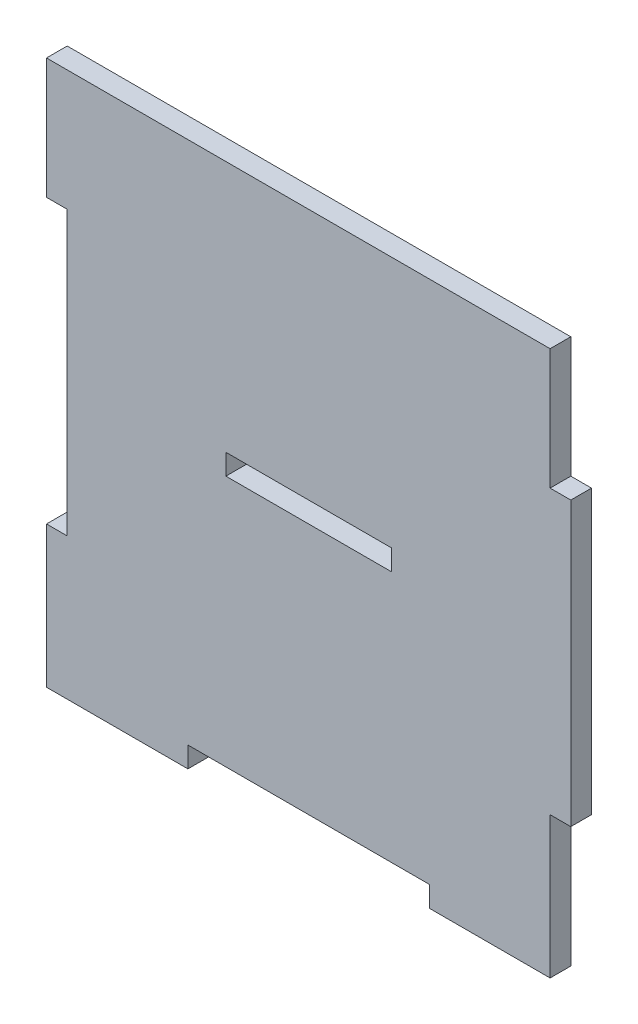
ISO-10303-21;
HEADER;
FILE_DESCRIPTION(('STEP AP214'),'2;1');
FILE_NAME('part.step','',(''),(''),'','','');
FILE_SCHEMA(('AUTOMOTIVE_DESIGN { 1 0 10303 214 1 1 1 1 }'));
ENDSEC;
DATA;
#1=APPLICATION_CONTEXT('core data for automotive mechanical design processes');
#2=APPLICATION_PROTOCOL_DEFINITION('international standard','automotive_design',2000,#1);
#3=PRODUCT_CONTEXT('',#1,'mechanical');
#4=PRODUCT('Part','Part','',(#3));
#5=PRODUCT_RELATED_PRODUCT_CATEGORY('part','',(#4));
#6=PRODUCT_DEFINITION_FORMATION('','',#4);
#7=PRODUCT_DEFINITION_CONTEXT('part definition',#1,'design');
#8=PRODUCT_DEFINITION('design','',#6,#7);
#9=PRODUCT_DEFINITION_SHAPE('','',#8);
#10=(LENGTH_UNIT() NAMED_UNIT(*) SI_UNIT(.MILLI.,.METRE.));
#11=(NAMED_UNIT(*) PLANE_ANGLE_UNIT() SI_UNIT($,.RADIAN.));
#12=(NAMED_UNIT(*) SI_UNIT($,.STERADIAN.) SOLID_ANGLE_UNIT());
#13=UNCERTAINTY_MEASURE_WITH_UNIT(LENGTH_MEASURE(1.E-05),#10,'distance_accuracy_value','');
#14=(GEOMETRIC_REPRESENTATION_CONTEXT(3) GLOBAL_UNCERTAINTY_ASSIGNED_CONTEXT((#13)) GLOBAL_UNIT_ASSIGNED_CONTEXT((#10,
#11,#12)) REPRESENTATION_CONTEXT('',''));
#15=CARTESIAN_POINT('',(0.,0.,0.));
#16=DIRECTION('',(0.,0.,1.));
#17=DIRECTION('',(1.,0.,0.));
#18=AXIS2_PLACEMENT_3D('',#15,#16,#17);
#19=CARTESIAN_POINT('',(35.,-20.5,3.));
#20=DIRECTION('',(0.,1.,0.));
#21=DIRECTION('',(-1.,0.,0.));
#22=AXIS2_PLACEMENT_3D('',#19,#20,#21);
#23=PLANE('',#22);
#24=DIRECTION('',(1.,0.,0.));
#25=VECTOR('',#24,1.);
#26=CARTESIAN_POINT('',(35.,-20.5,0.));
#27=LINE('',#26,#25);
#28=CARTESIAN_POINT('',(35.,-20.5,0.));
#29=VERTEX_POINT('',#28);
#30=CARTESIAN_POINT('',(38.,-20.5,0.));
#31=VERTEX_POINT('',#30);
#32=EDGE_CURVE('E218',#29,#31,#27,.T.);
#33=ORIENTED_EDGE('',*,*,#32,.T.);
#34=DIRECTION('',(0.,0.,-1.));
#35=VECTOR('',#34,1.);
#36=CARTESIAN_POINT('',(38.,-20.5,3.));
#37=LINE('',#36,#35);
#38=CARTESIAN_POINT('',(38.,-20.5,3.));
#39=VERTEX_POINT('',#38);
#40=EDGE_CURVE('E46',#39,#31,#37,.T.);
#41=ORIENTED_EDGE('',*,*,#40,.F.);
#42=DIRECTION('',(1.,0.,0.));
#43=VECTOR('',#42,1.);
#44=CARTESIAN_POINT('',(35.,-20.5,3.));
#45=LINE('',#44,#43);
#46=CARTESIAN_POINT('',(35.,-20.5,3.));
#47=VERTEX_POINT('',#46);
#48=EDGE_CURVE('E228',#47,#39,#45,.T.);
#49=ORIENTED_EDGE('',*,*,#48,.F.);
#50=DIRECTION('',(0.,0.,-1.));
#51=VECTOR('',#50,1.);
#52=CARTESIAN_POINT('',(35.,-20.5,3.));
#53=LINE('',#52,#51);
#54=EDGE_CURVE('E11',#47,#29,#53,.T.);
#55=ORIENTED_EDGE('',*,*,#54,.T.);
#56=EDGE_LOOP('',(#33,#41,#49,#55));
#57=FACE_BOUND('',#56,.T.);
#58=ADVANCED_FACE('F38',(#57),#23,.F.);
#59=CARTESIAN_POINT('',(38.,20.5,3.));
#60=DIRECTION('',(-1.,0.,0.));
#61=DIRECTION('',(0.,0.,1.));
#62=AXIS2_PLACEMENT_3D('',#59,#60,#61);
#63=PLANE('',#62);
#64=DIRECTION('',(0.,1.,0.));
#65=VECTOR('',#64,1.);
#66=CARTESIAN_POINT('',(38.,20.5,0.));
#67=LINE('',#66,#65);
#68=CARTESIAN_POINT('',(38.,20.5,0.));
#69=VERTEX_POINT('',#68);
#70=EDGE_CURVE('E278',#31,#69,#67,.T.);
#71=ORIENTED_EDGE('',*,*,#70,.T.);
#72=DIRECTION('',(0.,0.,-1.));
#73=VECTOR('',#72,1.);
#74=CARTESIAN_POINT('',(38.,20.5,3.));
#75=LINE('',#74,#73);
#76=CARTESIAN_POINT('',(38.,20.5,3.));
#77=VERTEX_POINT('',#76);
#78=EDGE_CURVE('E376',#77,#69,#75,.T.);
#79=ORIENTED_EDGE('',*,*,#78,.F.);
#80=DIRECTION('',(0.,1.,0.));
#81=VECTOR('',#80,1.);
#82=CARTESIAN_POINT('',(38.,20.5,3.));
#83=LINE('',#82,#81);
#84=EDGE_CURVE('E232',#39,#77,#83,.T.);
#85=ORIENTED_EDGE('',*,*,#84,.F.);
#86=ORIENTED_EDGE('',*,*,#40,.T.);
#87=EDGE_LOOP('',(#71,#79,#85,#86));
#88=FACE_BOUND('',#87,.T.);
#89=ADVANCED_FACE('F385',(#88),#63,.F.);
#90=CARTESIAN_POINT('',(35.,20.5,3.));
#91=DIRECTION('',(0.,-1.,0.));
#92=DIRECTION('',(1.,0.,0.));
#93=AXIS2_PLACEMENT_3D('',#90,#91,#92);
#94=PLANE('',#93);
#95=DIRECTION('',(-1.,0.,0.));
#96=VECTOR('',#95,1.);
#97=CARTESIAN_POINT('',(35.,20.5,0.));
#98=LINE('',#97,#96);
#99=CARTESIAN_POINT('',(35.,20.5,0.));
#100=VERTEX_POINT('',#99);
#101=EDGE_CURVE('E281',#69,#100,#98,.T.);
#102=ORIENTED_EDGE('',*,*,#101,.T.);
#103=DIRECTION('',(0.,0.,-1.));
#104=VECTOR('',#103,1.);
#105=CARTESIAN_POINT('',(35.,20.5,3.));
#106=LINE('',#105,#104);
#107=CARTESIAN_POINT('',(35.,20.5,3.));
#108=VERTEX_POINT('',#107);
#109=EDGE_CURVE('E372',#108,#100,#106,.T.);
#110=ORIENTED_EDGE('',*,*,#109,.F.);
#111=DIRECTION('',(-1.,0.,0.));
#112=VECTOR('',#111,1.);
#113=CARTESIAN_POINT('',(35.,20.5,3.));
#114=LINE('',#113,#112);
#115=EDGE_CURVE('E235',#77,#108,#114,.T.);
#116=ORIENTED_EDGE('',*,*,#115,.F.);
#117=ORIENTED_EDGE('',*,*,#78,.T.);
#118=EDGE_LOOP('',(#102,#110,#116,#117));
#119=FACE_BOUND('',#118,.T.);
#120=ADVANCED_FACE('F394',(#119),#94,.F.);
#121=CARTESIAN_POINT('',(35.,38.,3.));
#122=DIRECTION('',(-1.,0.,0.));
#123=DIRECTION('',(0.,-1.,0.));
#124=AXIS2_PLACEMENT_3D('',#121,#122,#123);
#125=PLANE('',#124);
#126=DIRECTION('',(0.,1.,0.));
#127=VECTOR('',#126,1.);
#128=CARTESIAN_POINT('',(35.,38.,0.));
#129=LINE('',#128,#127);
#130=CARTESIAN_POINT('',(35.,38.,0.));
#131=VERTEX_POINT('',#130);
#132=EDGE_CURVE('E284',#100,#131,#129,.T.);
#133=ORIENTED_EDGE('',*,*,#132,.T.);
#134=DIRECTION('',(0.,0.,-1.));
#135=VECTOR('',#134,1.);
#136=CARTESIAN_POINT('',(35.,38.,3.));
#137=LINE('',#136,#135);
#138=CARTESIAN_POINT('',(35.,38.,3.));
#139=VERTEX_POINT('',#138);
#140=EDGE_CURVE('E368',#139,#131,#137,.T.);
#141=ORIENTED_EDGE('',*,*,#140,.F.);
#142=DIRECTION('',(0.,1.,0.));
#143=VECTOR('',#142,1.);
#144=CARTESIAN_POINT('',(35.,38.,3.));
#145=LINE('',#144,#143);
#146=EDGE_CURVE('E238',#108,#139,#145,.T.);
#147=ORIENTED_EDGE('',*,*,#146,.F.);
#148=ORIENTED_EDGE('',*,*,#109,.T.);
#149=EDGE_LOOP('',(#133,#141,#147,#148));
#150=FACE_BOUND('',#149,.T.);
#151=ADVANCED_FACE('F398',(#150),#125,.F.);
#152=CARTESIAN_POINT('',(-38.,38.,3.));
#153=DIRECTION('',(0.,-1.,0.));
#154=DIRECTION('',(0.,0.,-1.));
#155=AXIS2_PLACEMENT_3D('',#152,#153,#154);
#156=PLANE('',#155);
#157=DIRECTION('',(-1.,0.,0.));
#158=VECTOR('',#157,1.);
#159=CARTESIAN_POINT('',(-38.,38.,0.));
#160=LINE('',#159,#158);
#161=CARTESIAN_POINT('',(-38.,38.,0.));
#162=VERTEX_POINT('',#161);
#163=EDGE_CURVE('E288',#131,#162,#160,.T.);
#164=ORIENTED_EDGE('',*,*,#163,.T.);
#165=DIRECTION('',(0.,0.,-1.));
#166=VECTOR('',#165,1.);
#167=CARTESIAN_POINT('',(-38.,38.,3.));
#168=LINE('',#167,#166);
#169=CARTESIAN_POINT('',(-38.,38.,3.));
#170=VERTEX_POINT('',#169);
#171=EDGE_CURVE('E364',#170,#162,#168,.T.);
#172=ORIENTED_EDGE('',*,*,#171,.F.);
#173=DIRECTION('',(-1.,0.,0.));
#174=VECTOR('',#173,1.);
#175=CARTESIAN_POINT('',(17.5,38.,3.));
#176=LINE('',#175,#174);
#177=EDGE_CURVE('E241',#139,#170,#176,.T.);
#178=ORIENTED_EDGE('',*,*,#177,.F.);
#179=ORIENTED_EDGE('',*,*,#140,.T.);
#180=EDGE_LOOP('',(#164,#172,#178,#179));
#181=FACE_BOUND('',#180,.T.);
#182=ADVANCED_FACE('F456',(#181),#156,.F.);
#183=CARTESIAN_POINT('',(-38.,20.5,3.));
#184=DIRECTION('',(1.,0.,0.));
#185=DIRECTION('',(0.,0.,-1.));
#186=AXIS2_PLACEMENT_3D('',#183,#184,#185);
#187=PLANE('',#186);
#188=DIRECTION('',(0.,-1.,0.));
#189=VECTOR('',#188,1.);
#190=CARTESIAN_POINT('',(-38.,20.5,0.));
#191=LINE('',#190,#189);
#192=CARTESIAN_POINT('',(-38.,20.5,0.));
#193=VERTEX_POINT('',#192);
#194=EDGE_CURVE('E291',#162,#193,#191,.T.);
#195=ORIENTED_EDGE('',*,*,#194,.T.);
#196=DIRECTION('',(0.,0.,-1.));
#197=VECTOR('',#196,1.);
#198=CARTESIAN_POINT('',(-38.,20.5,3.));
#199=LINE('',#198,#197);
#200=CARTESIAN_POINT('',(-38.,20.5,3.));
#201=VERTEX_POINT('',#200);
#202=EDGE_CURVE('E360',#201,#193,#199,.T.);
#203=ORIENTED_EDGE('',*,*,#202,.F.);
#204=DIRECTION('',(0.,-1.,0.));
#205=VECTOR('',#204,1.);
#206=CARTESIAN_POINT('',(-38.,20.5,3.));
#207=LINE('',#206,#205);
#208=EDGE_CURVE('E244',#170,#201,#207,.T.);
#209=ORIENTED_EDGE('',*,*,#208,.F.);
#210=ORIENTED_EDGE('',*,*,#171,.T.);
#211=EDGE_LOOP('',(#195,#203,#209,#210));
#212=FACE_BOUND('',#211,.T.);
#213=ADVANCED_FACE('F454',(#212),#187,.F.);
#214=CARTESIAN_POINT('',(-35.,20.5,3.));
#215=DIRECTION('',(0.,1.,0.));
#216=DIRECTION('',(0.,0.,1.));
#217=AXIS2_PLACEMENT_3D('',#214,#215,#216);
#218=PLANE('',#217);
#219=DIRECTION('',(1.,0.,0.));
#220=VECTOR('',#219,1.);
#221=CARTESIAN_POINT('',(-35.,20.5,0.));
#222=LINE('',#221,#220);
#223=CARTESIAN_POINT('',(-35.,20.5,0.));
#224=VERTEX_POINT('',#223);
#225=EDGE_CURVE('E294',#193,#224,#222,.T.);
#226=ORIENTED_EDGE('',*,*,#225,.T.);
#227=DIRECTION('',(0.,0.,-1.));
#228=VECTOR('',#227,1.);
#229=CARTESIAN_POINT('',(-35.,20.5,3.));
#230=LINE('',#229,#228);
#231=CARTESIAN_POINT('',(-35.,20.5,3.));
#232=VERTEX_POINT('',#231);
#233=EDGE_CURVE('E356',#232,#224,#230,.T.);
#234=ORIENTED_EDGE('',*,*,#233,.F.);
#235=DIRECTION('',(1.,0.,0.));
#236=VECTOR('',#235,1.);
#237=CARTESIAN_POINT('',(-35.,20.5,3.));
#238=LINE('',#237,#236);
#239=EDGE_CURVE('E247',#201,#232,#238,.T.);
#240=ORIENTED_EDGE('',*,*,#239,.F.);
#241=ORIENTED_EDGE('',*,*,#202,.T.);
#242=EDGE_LOOP('',(#226,#234,#240,#241));
#243=FACE_BOUND('',#242,.T.);
#244=ADVANCED_FACE('F449',(#243),#218,.F.);
#245=CARTESIAN_POINT('',(-35.,20.5,3.));
#246=DIRECTION('',(1.,0.,0.));
#247=DIRECTION('',(0.,0.,-1.));
#248=AXIS2_PLACEMENT_3D('',#245,#246,#247);
#249=PLANE('',#248);
#250=DIRECTION('',(0.,-1.,0.));
#251=VECTOR('',#250,1.);
#252=CARTESIAN_POINT('',(-35.,20.5,0.));
#253=LINE('',#252,#251);
#254=CARTESIAN_POINT('',(-35.,-20.5,0.));
#255=VERTEX_POINT('',#254);
#256=EDGE_CURVE('E297',#224,#255,#253,.T.);
#257=ORIENTED_EDGE('',*,*,#256,.T.);
#258=DIRECTION('',(0.,0.,-1.));
#259=VECTOR('',#258,1.);
#260=CARTESIAN_POINT('',(-35.,-20.5,3.));
#261=LINE('',#260,#259);
#262=CARTESIAN_POINT('',(-35.,-20.5,3.));
#263=VERTEX_POINT('',#262);
#264=EDGE_CURVE('E352',#263,#255,#261,.T.);
#265=ORIENTED_EDGE('',*,*,#264,.F.);
#266=DIRECTION('',(0.,-1.,0.));
#267=VECTOR('',#266,1.);
#268=CARTESIAN_POINT('',(-35.,20.5,3.));
#269=LINE('',#268,#267);
#270=EDGE_CURVE('E250',#232,#263,#269,.T.);
#271=ORIENTED_EDGE('',*,*,#270,.F.);
#272=ORIENTED_EDGE('',*,*,#233,.T.);
#273=EDGE_LOOP('',(#257,#265,#271,#272));
#274=FACE_BOUND('',#273,.T.);
#275=ADVANCED_FACE('F444',(#274),#249,.F.);
#276=CARTESIAN_POINT('',(-35.,-20.5,3.));
#277=DIRECTION('',(0.,-1.,0.));
#278=DIRECTION('',(0.,0.,-1.));
#279=AXIS2_PLACEMENT_3D('',#276,#277,#278);
#280=PLANE('',#279);
#281=DIRECTION('',(-1.,0.,0.));
#282=VECTOR('',#281,1.);
#283=CARTESIAN_POINT('',(-35.,-20.5,0.));
#284=LINE('',#283,#282);
#285=CARTESIAN_POINT('',(-38.,-20.5,0.));
#286=VERTEX_POINT('',#285);
#287=EDGE_CURVE('E300',#255,#286,#284,.T.);
#288=ORIENTED_EDGE('',*,*,#287,.T.);
#289=DIRECTION('',(0.,0.,-1.));
#290=VECTOR('',#289,1.);
#291=CARTESIAN_POINT('',(-38.,-20.5,3.));
#292=LINE('',#291,#290);
#293=CARTESIAN_POINT('',(-38.,-20.5,3.));
#294=VERTEX_POINT('',#293);
#295=EDGE_CURVE('E348',#294,#286,#292,.T.);
#296=ORIENTED_EDGE('',*,*,#295,.F.);
#297=DIRECTION('',(-1.,0.,0.));
#298=VECTOR('',#297,1.);
#299=CARTESIAN_POINT('',(-35.,-20.5,3.));
#300=LINE('',#299,#298);
#301=EDGE_CURVE('E253',#263,#294,#300,.T.);
#302=ORIENTED_EDGE('',*,*,#301,.F.);
#303=ORIENTED_EDGE('',*,*,#264,.T.);
#304=EDGE_LOOP('',(#288,#296,#302,#303));
#305=FACE_BOUND('',#304,.T.);
#306=ADVANCED_FACE('F439',(#305),#280,.F.);
#307=CARTESIAN_POINT('',(-38.,-38.,3.));
#308=DIRECTION('',(1.,0.,0.));
#309=DIRECTION('',(0.,0.,-1.));
#310=AXIS2_PLACEMENT_3D('',#307,#308,#309);
#311=PLANE('',#310);
#312=DIRECTION('',(0.,-1.,0.));
#313=VECTOR('',#312,1.);
#314=CARTESIAN_POINT('',(-38.,-38.,0.));
#315=LINE('',#314,#313);
#316=CARTESIAN_POINT('',(-38.,-41.,0.));
#317=VERTEX_POINT('',#316);
#318=EDGE_CURVE('E304',#286,#317,#315,.T.);
#319=ORIENTED_EDGE('',*,*,#318,.T.);
#320=DIRECTION('',(0.,0.,-1.));
#321=VECTOR('',#320,1.);
#322=CARTESIAN_POINT('',(-38.,-41.,3.));
#323=LINE('',#322,#321);
#324=CARTESIAN_POINT('',(-38.,-41.,3.));
#325=VERTEX_POINT('',#324);
#326=EDGE_CURVE('E344',#325,#317,#323,.T.);
#327=ORIENTED_EDGE('',*,*,#326,.F.);
#328=DIRECTION('',(0.,-1.,0.));
#329=VECTOR('',#328,1.);
#330=CARTESIAN_POINT('',(-38.,-20.5,3.));
#331=LINE('',#330,#329);
#332=EDGE_CURVE('E256',#294,#325,#331,.T.);
#333=ORIENTED_EDGE('',*,*,#332,.F.);
#334=ORIENTED_EDGE('',*,*,#295,.T.);
#335=EDGE_LOOP('',(#319,#327,#333,#334));
#336=FACE_BOUND('',#335,.T.);
#337=ADVANCED_FACE('F434',(#336),#311,.F.);
#338=CARTESIAN_POINT('',(-35.,-41.,3.));
#339=DIRECTION('',(0.,1.,0.));
#340=DIRECTION('',(0.,0.,1.));
#341=AXIS2_PLACEMENT_3D('',#338,#339,#340);
#342=PLANE('',#341);
#343=DIRECTION('',(1.,0.,0.));
#344=VECTOR('',#343,1.);
#345=CARTESIAN_POINT('',(-35.,-41.,0.));
#346=LINE('',#345,#344);
#347=CARTESIAN_POINT('',(-17.5,-41.,0.));
#348=VERTEX_POINT('',#347);
#349=EDGE_CURVE('E308',#317,#348,#346,.T.);
#350=ORIENTED_EDGE('',*,*,#349,.T.);
#351=DIRECTION('',(0.,0.,-1.));
#352=VECTOR('',#351,1.);
#353=CARTESIAN_POINT('',(-17.5,-41.,3.));
#354=LINE('',#353,#352);
#355=CARTESIAN_POINT('',(-17.5,-41.,3.));
#356=VERTEX_POINT('',#355);
#357=EDGE_CURVE('E340',#356,#348,#354,.T.);
#358=ORIENTED_EDGE('',*,*,#357,.F.);
#359=DIRECTION('',(1.,0.,0.));
#360=VECTOR('',#359,1.);
#361=CARTESIAN_POINT('',(-38.,-41.,3.));
#362=LINE('',#361,#360);
#363=EDGE_CURVE('E259',#325,#356,#362,.T.);
#364=ORIENTED_EDGE('',*,*,#363,.F.);
#365=ORIENTED_EDGE('',*,*,#326,.T.);
#366=EDGE_LOOP('',(#350,#358,#364,#365));
#367=FACE_BOUND('',#366,.T.);
#368=ADVANCED_FACE('F430',(#367),#342,.F.);
#369=CARTESIAN_POINT('',(-17.5,-38.,3.));
#370=DIRECTION('',(-1.,0.,0.));
#371=DIRECTION('',(0.,0.,1.));
#372=AXIS2_PLACEMENT_3D('',#369,#370,#371);
#373=PLANE('',#372);
#374=DIRECTION('',(0.,1.,0.));
#375=VECTOR('',#374,1.);
#376=CARTESIAN_POINT('',(-17.5,-38.,0.));
#377=LINE('',#376,#375);
#378=CARTESIAN_POINT('',(-17.5,-38.,0.));
#379=VERTEX_POINT('',#378);
#380=EDGE_CURVE('E311',#348,#379,#377,.T.);
#381=ORIENTED_EDGE('',*,*,#380,.T.);
#382=DIRECTION('',(0.,0.,-1.));
#383=VECTOR('',#382,1.);
#384=CARTESIAN_POINT('',(-17.5,-38.,3.));
#385=LINE('',#384,#383);
#386=CARTESIAN_POINT('',(-17.5,-38.,3.));
#387=VERTEX_POINT('',#386);
#388=EDGE_CURVE('E336',#387,#379,#385,.T.);
#389=ORIENTED_EDGE('',*,*,#388,.F.);
#390=DIRECTION('',(0.,1.,0.));
#391=VECTOR('',#390,1.);
#392=CARTESIAN_POINT('',(-17.5,-38.,3.));
#393=LINE('',#392,#391);
#394=EDGE_CURVE('E262',#356,#387,#393,.T.);
#395=ORIENTED_EDGE('',*,*,#394,.F.);
#396=ORIENTED_EDGE('',*,*,#357,.T.);
#397=EDGE_LOOP('',(#381,#389,#395,#396));
#398=FACE_BOUND('',#397,.T.);
#399=ADVANCED_FACE('F425',(#398),#373,.F.);
#400=CARTESIAN_POINT('',(-17.5,-38.,3.));
#401=DIRECTION('',(0.,1.,0.));
#402=DIRECTION('',(-1.,0.,0.));
#403=AXIS2_PLACEMENT_3D('',#400,#401,#402);
#404=PLANE('',#403);
#405=DIRECTION('',(1.,0.,0.));
#406=VECTOR('',#405,1.);
#407=CARTESIAN_POINT('',(-17.5,-38.,0.));
#408=LINE('',#407,#406);
#409=CARTESIAN_POINT('',(17.5,-38.,0.));
#410=VERTEX_POINT('',#409);
#411=EDGE_CURVE('E314',#379,#410,#408,.T.);
#412=ORIENTED_EDGE('',*,*,#411,.T.);
#413=DIRECTION('',(0.,0.,-1.));
#414=VECTOR('',#413,1.);
#415=CARTESIAN_POINT('',(17.5,-38.,3.));
#416=LINE('',#415,#414);
#417=CARTESIAN_POINT('',(17.5,-38.,3.));
#418=VERTEX_POINT('',#417);
#419=EDGE_CURVE('E332',#418,#410,#416,.T.);
#420=ORIENTED_EDGE('',*,*,#419,.F.);
#421=DIRECTION('',(1.,0.,0.));
#422=VECTOR('',#421,1.);
#423=CARTESIAN_POINT('',(-17.5,-38.,3.));
#424=LINE('',#423,#422);
#425=EDGE_CURVE('E265',#387,#418,#424,.T.);
#426=ORIENTED_EDGE('',*,*,#425,.F.);
#427=ORIENTED_EDGE('',*,*,#388,.T.);
#428=EDGE_LOOP('',(#412,#420,#426,#427));
#429=FACE_BOUND('',#428,.T.);
#430=ADVANCED_FACE('F421',(#429),#404,.F.);
#431=CARTESIAN_POINT('',(17.5,-41.,3.));
#432=DIRECTION('',(1.,0.,0.));
#433=DIRECTION('',(0.,1.,0.));
#434=AXIS2_PLACEMENT_3D('',#431,#432,#433);
#435=PLANE('',#434);
#436=DIRECTION('',(0.,-1.,0.));
#437=VECTOR('',#436,1.);
#438=CARTESIAN_POINT('',(17.5,-41.,0.));
#439=LINE('',#438,#437);
#440=CARTESIAN_POINT('',(17.5,-41.,0.));
#441=VERTEX_POINT('',#440);
#442=EDGE_CURVE('E317',#410,#441,#439,.T.);
#443=ORIENTED_EDGE('',*,*,#442,.T.);
#444=DIRECTION('',(0.,0.,-1.));
#445=VECTOR('',#444,1.);
#446=CARTESIAN_POINT('',(17.5,-41.,3.));
#447=LINE('',#446,#445);
#448=CARTESIAN_POINT('',(17.5,-41.,3.));
#449=VERTEX_POINT('',#448);
#450=EDGE_CURVE('E328',#449,#441,#447,.T.);
#451=ORIENTED_EDGE('',*,*,#450,.F.);
#452=DIRECTION('',(0.,-1.,0.));
#453=VECTOR('',#452,1.);
#454=CARTESIAN_POINT('',(17.5,-41.,3.));
#455=LINE('',#454,#453);
#456=EDGE_CURVE('E268',#418,#449,#455,.T.);
#457=ORIENTED_EDGE('',*,*,#456,.F.);
#458=ORIENTED_EDGE('',*,*,#419,.T.);
#459=EDGE_LOOP('',(#443,#451,#457,#458));
#460=FACE_BOUND('',#459,.T.);
#461=ADVANCED_FACE('F417',(#460),#435,.F.);
#462=CARTESIAN_POINT('',(35.,-41.,3.));
#463=DIRECTION('',(0.,1.,0.));
#464=DIRECTION('',(-1.,0.,0.));
#465=AXIS2_PLACEMENT_3D('',#462,#463,#464);
#466=PLANE('',#465);
#467=DIRECTION('',(1.,0.,0.));
#468=VECTOR('',#467,1.);
#469=CARTESIAN_POINT('',(35.,-41.,0.));
#470=LINE('',#469,#468);
#471=CARTESIAN_POINT('',(35.,-41.,0.));
#472=VERTEX_POINT('',#471);
#473=EDGE_CURVE('E320',#441,#472,#470,.T.);
#474=ORIENTED_EDGE('',*,*,#473,.T.);
#475=DIRECTION('',(0.,0.,-1.));
#476=VECTOR('',#475,1.);
#477=CARTESIAN_POINT('',(35.,-41.,3.));
#478=LINE('',#477,#476);
#479=CARTESIAN_POINT('',(35.,-41.,3.));
#480=VERTEX_POINT('',#479);
#481=EDGE_CURVE('E275',#480,#472,#478,.T.);
#482=ORIENTED_EDGE('',*,*,#481,.F.);
#483=DIRECTION('',(1.,0.,0.));
#484=VECTOR('',#483,1.);
#485=CARTESIAN_POINT('',(35.,-41.,3.));
#486=LINE('',#485,#484);
#487=EDGE_CURVE('E271',#449,#480,#486,.T.);
#488=ORIENTED_EDGE('',*,*,#487,.F.);
#489=ORIENTED_EDGE('',*,*,#450,.T.);
#490=EDGE_LOOP('',(#474,#482,#488,#489));
#491=FACE_BOUND('',#490,.T.);
#492=ADVANCED_FACE('F412',(#491),#466,.F.);
#493=CARTESIAN_POINT('',(35.,-38.,3.));
#494=DIRECTION('',(-1.,0.,0.));
#495=DIRECTION('',(0.,-1.,0.));
#496=AXIS2_PLACEMENT_3D('',#493,#494,#495);
#497=PLANE('',#496);
#498=DIRECTION('',(0.,1.,0.));
#499=VECTOR('',#498,1.);
#500=CARTESIAN_POINT('',(35.,-38.,0.));
#501=LINE('',#500,#499);
#502=EDGE_CURVE('E229',#472,#29,#501,.T.);
#503=ORIENTED_EDGE('',*,*,#502,.T.);
#504=ORIENTED_EDGE('',*,*,#54,.F.);
#505=DIRECTION('',(0.,1.,0.));
#506=VECTOR('',#505,1.);
#507=CARTESIAN_POINT('',(35.,-20.5,3.));
#508=LINE('',#507,#506);
#509=EDGE_CURVE('E224',#480,#47,#508,.T.);
#510=ORIENTED_EDGE('',*,*,#509,.F.);
#511=ORIENTED_EDGE('',*,*,#481,.T.);
#512=EDGE_LOOP('',(#503,#504,#510,#511));
#513=FACE_BOUND('',#512,.T.);
#514=ADVANCED_FACE('F406',(#513),#497,.F.);
#515=CARTESIAN_POINT('',(0.,0.,3.));
#516=DIRECTION('',(0.,0.,-1.));
#517=DIRECTION('',(-1.,0.,0.));
#518=AXIS2_PLACEMENT_3D('',#515,#516,#517);
#519=PLANE('',#518);
#520=DIRECTION('',(-1.,0.,0.));
#521=VECTOR('',#520,1.);
#522=CARTESIAN_POINT('',(-12.,1.5,3.));
#523=LINE('',#522,#521);
#524=CARTESIAN_POINT('',(12.,1.5,3.));
#525=VERTEX_POINT('',#524);
#526=CARTESIAN_POINT('',(-12.,1.5,3.));
#527=VERTEX_POINT('',#526);
#528=EDGE_CURVE('E209',#525,#527,#523,.T.);
#529=ORIENTED_EDGE('',*,*,#528,.F.);
#530=DIRECTION('',(0.,1.,0.));
#531=VECTOR('',#530,1.);
#532=CARTESIAN_POINT('',(12.,-1.5,3.));
#533=LINE('',#532,#531);
#534=CARTESIAN_POINT('',(12.,-1.5,3.));
#535=VERTEX_POINT('',#534);
#536=EDGE_CURVE('E53',#535,#525,#533,.T.);
#537=ORIENTED_EDGE('',*,*,#536,.F.);
#538=DIRECTION('',(1.,0.,0.));
#539=VECTOR('',#538,1.);
#540=CARTESIAN_POINT('',(-12.,-1.5,3.));
#541=LINE('',#540,#539);
#542=CARTESIAN_POINT('',(-12.,-1.5,3.));
#543=VERTEX_POINT('',#542);
#544=EDGE_CURVE('E196',#543,#535,#541,.T.);
#545=ORIENTED_EDGE('',*,*,#544,.F.);
#546=DIRECTION('',(0.,-1.,0.));
#547=VECTOR('',#546,1.);
#548=CARTESIAN_POINT('',(-12.,-1.5,3.));
#549=LINE('',#548,#547);
#550=EDGE_CURVE('E200',#527,#543,#549,.T.);
#551=ORIENTED_EDGE('',*,*,#550,.F.);
#552=EDGE_LOOP('',(#529,#537,#545,#551));
#553=FACE_BOUND('',#552,.T.);
#554=ORIENTED_EDGE('',*,*,#509,.T.);
#555=ORIENTED_EDGE('',*,*,#48,.T.);
#556=ORIENTED_EDGE('',*,*,#84,.T.);
#557=ORIENTED_EDGE('',*,*,#115,.T.);
#558=ORIENTED_EDGE('',*,*,#146,.T.);
#559=ORIENTED_EDGE('',*,*,#177,.T.);
#560=ORIENTED_EDGE('',*,*,#208,.T.);
#561=ORIENTED_EDGE('',*,*,#239,.T.);
#562=ORIENTED_EDGE('',*,*,#270,.T.);
#563=ORIENTED_EDGE('',*,*,#301,.T.);
#564=ORIENTED_EDGE('',*,*,#332,.T.);
#565=ORIENTED_EDGE('',*,*,#363,.T.);
#566=ORIENTED_EDGE('',*,*,#394,.T.);
#567=ORIENTED_EDGE('',*,*,#425,.T.);
#568=ORIENTED_EDGE('',*,*,#456,.T.);
#569=ORIENTED_EDGE('',*,*,#487,.T.);
#570=EDGE_LOOP('',(#554,#555,#556,#557,#558,#559,#560,#561,#562,#563,#564,#565,#566,#567,#568,#569));
#571=FACE_BOUND('',#570,.T.);
#572=ADVANCED_FACE('F402',(#553,#571),#519,.F.);
#573=CARTESIAN_POINT('',(0.,0.,0.));
#574=DIRECTION('',(0.,0.,-1.));
#575=DIRECTION('',(-1.,0.,0.));
#576=AXIS2_PLACEMENT_3D('',#573,#574,#575);
#577=PLANE('',#576);
#578=DIRECTION('',(0.,1.,0.));
#579=VECTOR('',#578,1.);
#580=CARTESIAN_POINT('',(12.,-1.5,0.));
#581=LINE('',#580,#579);
#582=CARTESIAN_POINT('',(12.,-1.5,0.));
#583=VERTEX_POINT('',#582);
#584=CARTESIAN_POINT('',(12.,1.5,0.));
#585=VERTEX_POINT('',#584);
#586=EDGE_CURVE('E177',#583,#585,#581,.T.);
#587=ORIENTED_EDGE('',*,*,#586,.T.);
#588=DIRECTION('',(-1.,0.,0.));
#589=VECTOR('',#588,1.);
#590=CARTESIAN_POINT('',(-12.,1.5,0.));
#591=LINE('',#590,#589);
#592=CARTESIAN_POINT('',(-12.,1.5,0.));
#593=VERTEX_POINT('',#592);
#594=EDGE_CURVE('E187',#585,#593,#591,.T.);
#595=ORIENTED_EDGE('',*,*,#594,.T.);
#596=DIRECTION('',(0.,-1.,0.));
#597=VECTOR('',#596,1.);
#598=CARTESIAN_POINT('',(-12.,-1.5,0.));
#599=LINE('',#598,#597);
#600=CARTESIAN_POINT('',(-12.,-1.5,0.));
#601=VERTEX_POINT('',#600);
#602=EDGE_CURVE('E61',#593,#601,#599,.T.);
#603=ORIENTED_EDGE('',*,*,#602,.T.);
#604=DIRECTION('',(1.,0.,0.));
#605=VECTOR('',#604,1.);
#606=CARTESIAN_POINT('',(-12.,-1.5,0.));
#607=LINE('',#606,#605);
#608=EDGE_CURVE('E184',#601,#583,#607,.T.);
#609=ORIENTED_EDGE('',*,*,#608,.T.);
#610=EDGE_LOOP('',(#587,#595,#603,#609));
#611=FACE_BOUND('',#610,.T.);
#612=ORIENTED_EDGE('',*,*,#32,.F.);
#613=ORIENTED_EDGE('',*,*,#502,.F.);
#614=ORIENTED_EDGE('',*,*,#473,.F.);
#615=ORIENTED_EDGE('',*,*,#442,.F.);
#616=ORIENTED_EDGE('',*,*,#411,.F.);
#617=ORIENTED_EDGE('',*,*,#380,.F.);
#618=ORIENTED_EDGE('',*,*,#349,.F.);
#619=ORIENTED_EDGE('',*,*,#318,.F.);
#620=ORIENTED_EDGE('',*,*,#287,.F.);
#621=ORIENTED_EDGE('',*,*,#256,.F.);
#622=ORIENTED_EDGE('',*,*,#225,.F.);
#623=ORIENTED_EDGE('',*,*,#194,.F.);
#624=ORIENTED_EDGE('',*,*,#163,.F.);
#625=ORIENTED_EDGE('',*,*,#132,.F.);
#626=ORIENTED_EDGE('',*,*,#101,.F.);
#627=ORIENTED_EDGE('',*,*,#70,.F.);
#628=EDGE_LOOP('',(#612,#613,#614,#615,#616,#617,#618,#619,#620,#621,#622,#623,#624,#625,#626,#627));
#629=FACE_BOUND('',#628,.T.);
#630=ADVANCED_FACE('F192',(#611,#629),#577,.T.);
#631=CARTESIAN_POINT('',(12.,-1.5,0.));
#632=DIRECTION('',(1.,0.,0.));
#633=DIRECTION('',(0.,0.,-1.));
#634=AXIS2_PLACEMENT_3D('',#631,#632,#633);
#635=PLANE('',#634);
#636=ORIENTED_EDGE('',*,*,#536,.T.);
#637=DIRECTION('',(0.,0.,1.));
#638=VECTOR('',#637,1.);
#639=CARTESIAN_POINT('',(12.,1.5,0.));
#640=LINE('',#639,#638);
#641=EDGE_CURVE('E173',#585,#525,#640,.T.);
#642=ORIENTED_EDGE('',*,*,#641,.F.);
#643=ORIENTED_EDGE('',*,*,#586,.F.);
#644=DIRECTION('',(0.,0.,1.));
#645=VECTOR('',#644,1.);
#646=CARTESIAN_POINT('',(12.,-1.5,0.));
#647=LINE('',#646,#645);
#648=EDGE_CURVE('E215',#583,#535,#647,.T.);
#649=ORIENTED_EDGE('',*,*,#648,.T.);
#650=EDGE_LOOP('',(#636,#642,#643,#649));
#651=FACE_BOUND('',#650,.T.);
#652=ADVANCED_FACE('F175',(#651),#635,.F.);
#653=CARTESIAN_POINT('',(-12.,-1.5,0.));
#654=DIRECTION('',(0.,-1.,0.));
#655=DIRECTION('',(0.,0.,-1.));
#656=AXIS2_PLACEMENT_3D('',#653,#654,#655);
#657=PLANE('',#656);
#658=ORIENTED_EDGE('',*,*,#544,.T.);
#659=ORIENTED_EDGE('',*,*,#648,.F.);
#660=ORIENTED_EDGE('',*,*,#608,.F.);
#661=DIRECTION('',(0.,0.,1.));
#662=VECTOR('',#661,1.);
#663=CARTESIAN_POINT('',(-12.,-1.5,0.));
#664=LINE('',#663,#662);
#665=EDGE_CURVE('E219',#601,#543,#664,.T.);
#666=ORIENTED_EDGE('',*,*,#665,.T.);
#667=EDGE_LOOP('',(#658,#659,#660,#666));
#668=FACE_BOUND('',#667,.T.);
#669=ADVANCED_FACE('F596',(#668),#657,.F.);
#670=CARTESIAN_POINT('',(-12.,-1.5,0.));
#671=DIRECTION('',(-1.,0.,0.));
#672=DIRECTION('',(0.,0.,1.));
#673=AXIS2_PLACEMENT_3D('',#670,#671,#672);
#674=PLANE('',#673);
#675=ORIENTED_EDGE('',*,*,#550,.T.);
#676=ORIENTED_EDGE('',*,*,#665,.F.);
#677=ORIENTED_EDGE('',*,*,#602,.F.);
#678=DIRECTION('',(0.,0.,1.));
#679=VECTOR('',#678,1.);
#680=CARTESIAN_POINT('',(-12.,1.5,0.));
#681=LINE('',#680,#679);
#682=EDGE_CURVE('E183',#593,#527,#681,.T.);
#683=ORIENTED_EDGE('',*,*,#682,.T.);
#684=EDGE_LOOP('',(#675,#676,#677,#683));
#685=FACE_BOUND('',#684,.T.);
#686=ADVANCED_FACE('F605',(#685),#674,.F.);
#687=CARTESIAN_POINT('',(-12.,1.5,0.));
#688=DIRECTION('',(0.,1.,0.));
#689=DIRECTION('',(0.,0.,1.));
#690=AXIS2_PLACEMENT_3D('',#687,#688,#689);
#691=PLANE('',#690);
#692=ORIENTED_EDGE('',*,*,#528,.T.);
#693=ORIENTED_EDGE('',*,*,#682,.F.);
#694=ORIENTED_EDGE('',*,*,#594,.F.);
#695=ORIENTED_EDGE('',*,*,#641,.T.);
#696=EDGE_LOOP('',(#692,#693,#694,#695));
#697=FACE_BOUND('',#696,.T.);
#698=ADVANCED_FACE('F188',(#697),#691,.F.);
#699=CLOSED_SHELL('',(#58,#89,#120,#151,#182,#213,#244,#275,#306,#337,#368,#399,#430,#461,#492,
#514,#572,#630,#652,#669,#686,#698));
#700=MANIFOLD_SOLID_BREP('B2',#699);
#701=ADVANCED_BREP_SHAPE_REPRESENTATION('',(#18,#700),#14);
#702=SHAPE_DEFINITION_REPRESENTATION(#9,#701);
ENDSEC;
END-ISO-10303-21;
